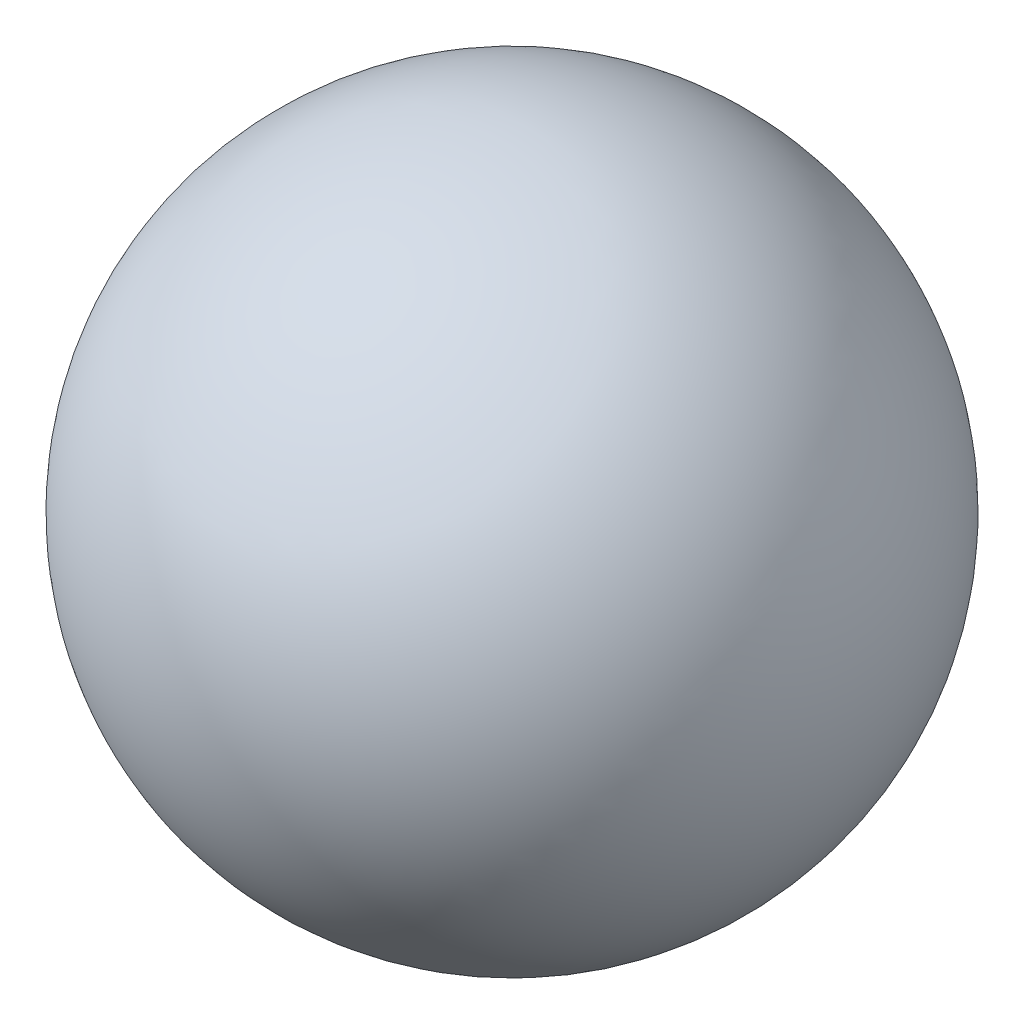
ISO-10303-21;
HEADER;
FILE_DESCRIPTION(('STEP AP214'),'2;1');
FILE_NAME('part.step','',(''),(''),'','','');
FILE_SCHEMA(('AUTOMOTIVE_DESIGN { 1 0 10303 214 1 1 1 1 }'));
ENDSEC;
DATA;
#1=APPLICATION_CONTEXT('core data for automotive mechanical design processes');
#2=APPLICATION_PROTOCOL_DEFINITION('international standard','automotive_design',2000,#1);
#3=PRODUCT_CONTEXT('',#1,'mechanical');
#4=PRODUCT('Part','Part','',(#3));
#5=PRODUCT_RELATED_PRODUCT_CATEGORY('part','',(#4));
#6=PRODUCT_DEFINITION_FORMATION('','',#4);
#7=PRODUCT_DEFINITION_CONTEXT('part definition',#1,'design');
#8=PRODUCT_DEFINITION('design','',#6,#7);
#9=PRODUCT_DEFINITION_SHAPE('','',#8);
#10=(LENGTH_UNIT() NAMED_UNIT(*) SI_UNIT(.MILLI.,.METRE.));
#11=(NAMED_UNIT(*) PLANE_ANGLE_UNIT() SI_UNIT($,.RADIAN.));
#12=(NAMED_UNIT(*) SI_UNIT($,.STERADIAN.) SOLID_ANGLE_UNIT());
#13=UNCERTAINTY_MEASURE_WITH_UNIT(LENGTH_MEASURE(1.E-05),#10,'distance_accuracy_value','');
#14=(GEOMETRIC_REPRESENTATION_CONTEXT(3) GLOBAL_UNCERTAINTY_ASSIGNED_CONTEXT((#13)) GLOBAL_UNIT_ASSIGNED_CONTEXT((#10,
#11,#12)) REPRESENTATION_CONTEXT('',''));
#15=CARTESIAN_POINT('',(0.,0.,0.));
#16=DIRECTION('',(0.,0.,1.));
#17=DIRECTION('',(1.,0.,0.));
#18=AXIS2_PLACEMENT_3D('',#15,#16,#17);
#19=CARTESIAN_POINT('',(-10.1757984944672,-2.,-5.875));
#20=DIRECTION('',(0.,0.,1.));
#21=DIRECTION('',(1.,0.,0.));
#22=AXIS2_PLACEMENT_3D('',#19,#20,#21);
#23=SPHERICAL_SURFACE('',#22,1.05);
#24=CARTESIAN_POINT('',(-10.1757984944672,-2.,-4.825));
#25=VERTEX_POINT('',#24);
#26=VERTEX_LOOP('',#25);
#27=FACE_BOUND('',#26,.T.);
#28=ADVANCED_FACE('F12',(#27),#23,.T.);
#29=CLOSED_SHELL('',(#28));
#30=MANIFOLD_SOLID_BREP('B1',#29);
#31=ADVANCED_BREP_SHAPE_REPRESENTATION('',(#18,#30),#14);
#32=SHAPE_DEFINITION_REPRESENTATION(#9,#31);
ENDSEC;
END-ISO-10303-21;
